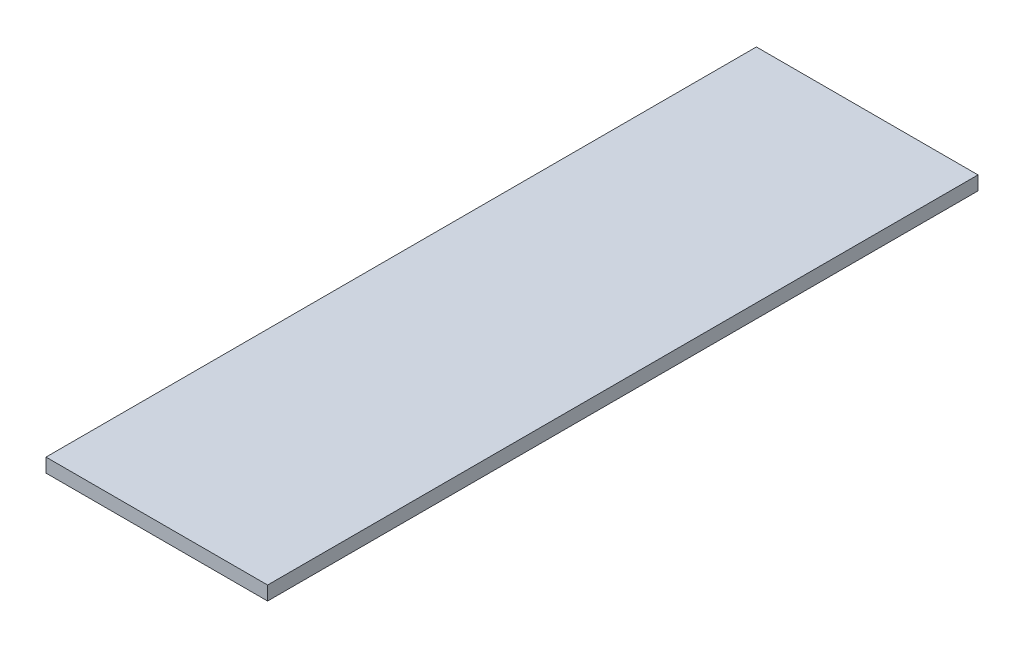
ISO-10303-21;
HEADER;
FILE_DESCRIPTION(('STEP AP214'),'2;1');
FILE_NAME('part.step','',(''),(''),'','','');
FILE_SCHEMA(('AUTOMOTIVE_DESIGN { 1 0 10303 214 1 1 1 1 }'));
ENDSEC;
DATA;
#1=APPLICATION_CONTEXT('core data for automotive mechanical design processes');
#2=APPLICATION_PROTOCOL_DEFINITION('international standard','automotive_design',2000,#1);
#3=PRODUCT_CONTEXT('',#1,'mechanical');
#4=PRODUCT('Part','Part','',(#3));
#5=PRODUCT_RELATED_PRODUCT_CATEGORY('part','',(#4));
#6=PRODUCT_DEFINITION_FORMATION('','',#4);
#7=PRODUCT_DEFINITION_CONTEXT('part definition',#1,'design');
#8=PRODUCT_DEFINITION('design','',#6,#7);
#9=PRODUCT_DEFINITION_SHAPE('','',#8);
#10=(LENGTH_UNIT() NAMED_UNIT(*) SI_UNIT(.MILLI.,.METRE.));
#11=(NAMED_UNIT(*) PLANE_ANGLE_UNIT() SI_UNIT($,.RADIAN.));
#12=(NAMED_UNIT(*) SI_UNIT($,.STERADIAN.) SOLID_ANGLE_UNIT());
#13=UNCERTAINTY_MEASURE_WITH_UNIT(LENGTH_MEASURE(1.E-05),#10,'distance_accuracy_value','');
#14=(GEOMETRIC_REPRESENTATION_CONTEXT(3) GLOBAL_UNCERTAINTY_ASSIGNED_CONTEXT((#13)) GLOBAL_UNIT_ASSIGNED_CONTEXT((#10,
#11,#12)) REPRESENTATION_CONTEXT('',''));
#15=CARTESIAN_POINT('',(0.,0.,0.));
#16=DIRECTION('',(0.,0.,1.));
#17=DIRECTION('',(1.,0.,0.));
#18=AXIS2_PLACEMENT_3D('',#15,#16,#17);
#19=CARTESIAN_POINT('',(-143.5,18.,460.));
#20=DIRECTION('',(1.,0.,0.));
#21=DIRECTION('',(0.,0.,-1.));
#22=AXIS2_PLACEMENT_3D('',#19,#20,#21);
#23=PLANE('',#22);
#24=DIRECTION('',(0.,0.,1.));
#25=VECTOR('',#24,1.);
#26=CARTESIAN_POINT('',(-143.5,0.,460.));
#27=LINE('',#26,#25);
#28=CARTESIAN_POINT('',(-143.5,0.,-460.));
#29=VERTEX_POINT('',#28);
#30=CARTESIAN_POINT('',(-143.5,0.,460.));
#31=VERTEX_POINT('',#30);
#32=EDGE_CURVE('E98',#29,#31,#27,.T.);
#33=ORIENTED_EDGE('',*,*,#32,.T.);
#34=DIRECTION('',(0.,-1.,0.));
#35=VECTOR('',#34,1.);
#36=CARTESIAN_POINT('',(-143.5,18.,460.));
#37=LINE('',#36,#35);
#38=CARTESIAN_POINT('',(-143.5,18.,460.));
#39=VERTEX_POINT('',#38);
#40=EDGE_CURVE('E11',#39,#31,#37,.T.);
#41=ORIENTED_EDGE('',*,*,#40,.F.);
#42=DIRECTION('',(0.,0.,1.));
#43=VECTOR('',#42,1.);
#44=CARTESIAN_POINT('',(-143.5,18.,460.));
#45=LINE('',#44,#43);
#46=CARTESIAN_POINT('',(-143.5,18.,-460.));
#47=VERTEX_POINT('',#46);
#48=EDGE_CURVE('E86',#47,#39,#45,.T.);
#49=ORIENTED_EDGE('',*,*,#48,.F.);
#50=DIRECTION('',(0.,-1.,0.));
#51=VECTOR('',#50,1.);
#52=CARTESIAN_POINT('',(-143.5,18.,-460.));
#53=LINE('',#52,#51);
#54=EDGE_CURVE('E94',#47,#29,#53,.T.);
#55=ORIENTED_EDGE('',*,*,#54,.T.);
#56=EDGE_LOOP('',(#33,#41,#49,#55));
#57=FACE_BOUND('',#56,.T.);
#58=ADVANCED_FACE('F35',(#57),#23,.F.);
#59=CARTESIAN_POINT('',(143.5,18.,460.));
#60=DIRECTION('',(0.,0.,-1.));
#61=DIRECTION('',(-1.,0.,0.));
#62=AXIS2_PLACEMENT_3D('',#59,#60,#61);
#63=PLANE('',#62);
#64=DIRECTION('',(1.,0.,0.));
#65=VECTOR('',#64,1.);
#66=CARTESIAN_POINT('',(143.5,0.,460.));
#67=LINE('',#66,#65);
#68=CARTESIAN_POINT('',(143.5,0.,460.));
#69=VERTEX_POINT('',#68);
#70=EDGE_CURVE('E90',#31,#69,#67,.T.);
#71=ORIENTED_EDGE('',*,*,#70,.T.);
#72=DIRECTION('',(0.,-1.,0.));
#73=VECTOR('',#72,1.);
#74=CARTESIAN_POINT('',(143.5,18.,460.));
#75=LINE('',#74,#73);
#76=CARTESIAN_POINT('',(143.5,18.,460.));
#77=VERTEX_POINT('',#76);
#78=EDGE_CURVE('E43',#77,#69,#75,.T.);
#79=ORIENTED_EDGE('',*,*,#78,.F.);
#80=DIRECTION('',(1.,0.,0.));
#81=VECTOR('',#80,1.);
#82=CARTESIAN_POINT('',(143.5,18.,460.));
#83=LINE('',#82,#81);
#84=EDGE_CURVE('E81',#39,#77,#83,.T.);
#85=ORIENTED_EDGE('',*,*,#84,.F.);
#86=ORIENTED_EDGE('',*,*,#40,.T.);
#87=EDGE_LOOP('',(#71,#79,#85,#86));
#88=FACE_BOUND('',#87,.T.);
#89=ADVANCED_FACE('F89',(#88),#63,.F.);
#90=CARTESIAN_POINT('',(143.5,18.,460.));
#91=DIRECTION('',(-1.,0.,0.));
#92=DIRECTION('',(0.,0.,1.));
#93=AXIS2_PLACEMENT_3D('',#90,#91,#92);
#94=PLANE('',#93);
#95=DIRECTION('',(0.,0.,-1.));
#96=VECTOR('',#95,1.);
#97=CARTESIAN_POINT('',(143.5,0.,460.));
#98=LINE('',#97,#96);
#99=CARTESIAN_POINT('',(143.5,0.,-460.));
#100=VERTEX_POINT('',#99);
#101=EDGE_CURVE('E68',#69,#100,#98,.T.);
#102=ORIENTED_EDGE('',*,*,#101,.T.);
#103=DIRECTION('',(0.,-1.,0.));
#104=VECTOR('',#103,1.);
#105=CARTESIAN_POINT('',(143.5,18.,-460.));
#106=LINE('',#105,#104);
#107=CARTESIAN_POINT('',(143.5,18.,-460.));
#108=VERTEX_POINT('',#107);
#109=EDGE_CURVE('E91',#108,#100,#106,.T.);
#110=ORIENTED_EDGE('',*,*,#109,.F.);
#111=DIRECTION('',(0.,0.,-1.));
#112=VECTOR('',#111,1.);
#113=CARTESIAN_POINT('',(143.5,18.,460.));
#114=LINE('',#113,#112);
#115=EDGE_CURVE('E84',#77,#108,#114,.T.);
#116=ORIENTED_EDGE('',*,*,#115,.F.);
#117=ORIENTED_EDGE('',*,*,#78,.T.);
#118=EDGE_LOOP('',(#102,#110,#116,#117));
#119=FACE_BOUND('',#118,.T.);
#120=ADVANCED_FACE('F92',(#119),#94,.F.);
#121=CARTESIAN_POINT('',(143.5,18.,-460.));
#122=DIRECTION('',(0.,0.,1.));
#123=DIRECTION('',(1.,0.,0.));
#124=AXIS2_PLACEMENT_3D('',#121,#122,#123);
#125=PLANE('',#124);
#126=DIRECTION('',(-1.,0.,0.));
#127=VECTOR('',#126,1.);
#128=CARTESIAN_POINT('',(143.5,0.,-460.));
#129=LINE('',#128,#127);
#130=EDGE_CURVE('E74',#100,#29,#129,.T.);
#131=ORIENTED_EDGE('',*,*,#130,.T.);
#132=ORIENTED_EDGE('',*,*,#54,.F.);
#133=DIRECTION('',(-1.,0.,0.));
#134=VECTOR('',#133,1.);
#135=CARTESIAN_POINT('',(143.5,18.,-460.));
#136=LINE('',#135,#134);
#137=EDGE_CURVE('E51',#108,#47,#136,.T.);
#138=ORIENTED_EDGE('',*,*,#137,.F.);
#139=ORIENTED_EDGE('',*,*,#109,.T.);
#140=EDGE_LOOP('',(#131,#132,#138,#139));
#141=FACE_BOUND('',#140,.T.);
#142=ADVANCED_FACE('F105',(#141),#125,.F.);
#143=CARTESIAN_POINT('',(0.,18.,0.));
#144=DIRECTION('',(0.,1.,0.));
#145=DIRECTION('',(0.,0.,1.));
#146=AXIS2_PLACEMENT_3D('',#143,#144,#145);
#147=PLANE('',#146);
#148=ORIENTED_EDGE('',*,*,#48,.T.);
#149=ORIENTED_EDGE('',*,*,#84,.T.);
#150=ORIENTED_EDGE('',*,*,#115,.T.);
#151=ORIENTED_EDGE('',*,*,#137,.T.);
#152=EDGE_LOOP('',(#148,#149,#150,#151));
#153=FACE_BOUND('',#152,.T.);
#154=ADVANCED_FACE('F82',(#153),#147,.T.);
#155=CARTESIAN_POINT('',(0.,0.,0.));
#156=DIRECTION('',(0.,1.,0.));
#157=DIRECTION('',(0.,0.,1.));
#158=AXIS2_PLACEMENT_3D('',#155,#156,#157);
#159=PLANE('',#158);
#160=ORIENTED_EDGE('',*,*,#32,.F.);
#161=ORIENTED_EDGE('',*,*,#130,.F.);
#162=ORIENTED_EDGE('',*,*,#101,.F.);
#163=ORIENTED_EDGE('',*,*,#70,.F.);
#164=EDGE_LOOP('',(#160,#161,#162,#163));
#165=FACE_BOUND('',#164,.T.);
#166=ADVANCED_FACE('F108',(#165),#159,.F.);
#167=CLOSED_SHELL('',(#58,#89,#120,#142,#154,#166));
#168=MANIFOLD_SOLID_BREP('B2',#167);
#169=ADVANCED_BREP_SHAPE_REPRESENTATION('',(#18,#168),#14);
#170=SHAPE_DEFINITION_REPRESENTATION(#9,#169);
ENDSEC;
END-ISO-10303-21;
